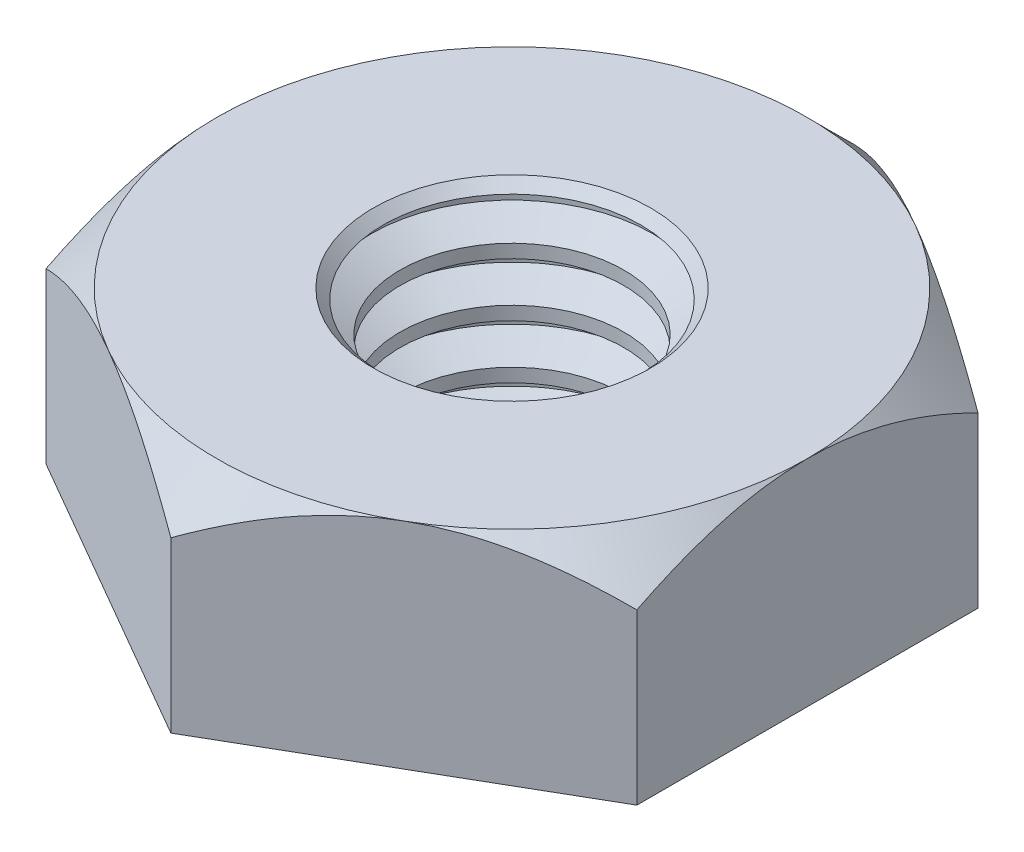
ISO-10303-21;
HEADER;
FILE_DESCRIPTION(('STEP AP214'),'2;1');
FILE_NAME('part.step','',(''),(''),'','','');
FILE_SCHEMA(('AUTOMOTIVE_DESIGN { 1 0 10303 214 1 1 1 1 }'));
ENDSEC;
DATA;
#1=APPLICATION_CONTEXT('core data for automotive mechanical design processes');
#2=APPLICATION_PROTOCOL_DEFINITION('international standard','automotive_design',2000,#1);
#3=PRODUCT_CONTEXT('',#1,'mechanical');
#4=PRODUCT('Part','Part','',(#3));
#5=PRODUCT_RELATED_PRODUCT_CATEGORY('part','',(#4));
#6=PRODUCT_DEFINITION_FORMATION('','',#4);
#7=PRODUCT_DEFINITION_CONTEXT('part definition',#1,'design');
#8=PRODUCT_DEFINITION('design','',#6,#7);
#9=PRODUCT_DEFINITION_SHAPE('','',#8);
#10=(LENGTH_UNIT() NAMED_UNIT(*) SI_UNIT(.MILLI.,.METRE.));
#11=(NAMED_UNIT(*) PLANE_ANGLE_UNIT() SI_UNIT($,.RADIAN.));
#12=(NAMED_UNIT(*) SI_UNIT($,.STERADIAN.) SOLID_ANGLE_UNIT());
#13=UNCERTAINTY_MEASURE_WITH_UNIT(LENGTH_MEASURE(1.E-05),#10,'distance_accuracy_value','');
#14=(GEOMETRIC_REPRESENTATION_CONTEXT(3) GLOBAL_UNCERTAINTY_ASSIGNED_CONTEXT((#13)) GLOBAL_UNIT_ASSIGNED_CONTEXT((#10,
#11,#12)) REPRESENTATION_CONTEXT('',''));
#15=CARTESIAN_POINT('',(0.,0.,0.));
#16=DIRECTION('',(0.,0.,1.));
#17=DIRECTION('',(1.,0.,0.));
#18=AXIS2_PLACEMENT_3D('',#15,#16,#17);
#19=CARTESIAN_POINT('',(4.365625,0.,-2.52049476893096));
#20=DIRECTION('',(0.,-1.,0.));
#21=DIRECTION('',(0.,0.,-1.));
#22=AXIS2_PLACEMENT_3D('',#19,#20,#21);
#23=PLANE('',#22);
#24=DIRECTION('',(-0.866025403784439,0.,-0.5));
#25=VECTOR('',#24,1.);
#26=CARTESIAN_POINT('',(4.365625,0.,-2.52049476893096));
#27=LINE('',#26,#25);
#28=CARTESIAN_POINT('',(4.365625,0.,-2.52049476893096));
#29=VERTEX_POINT('',#28);
#30=CARTESIAN_POINT('',(0.,0.,-5.04098953786192));
#31=VERTEX_POINT('',#30);
#32=EDGE_CURVE('E235',#29,#31,#27,.T.);
#33=ORIENTED_EDGE('',*,*,#32,.F.);
#34=DIRECTION('',(0.,0.,-1.));
#35=VECTOR('',#34,1.);
#36=CARTESIAN_POINT('',(4.365625,0.,2.52049476893096));
#37=LINE('',#36,#35);
#38=CARTESIAN_POINT('',(4.365625,0.,2.52049476893096));
#39=VERTEX_POINT('',#38);
#40=EDGE_CURVE('E297',#39,#29,#37,.T.);
#41=ORIENTED_EDGE('',*,*,#40,.F.);
#42=DIRECTION('',(0.866025403784439,0.,-0.5));
#43=VECTOR('',#42,1.);
#44=CARTESIAN_POINT('',(0.,0.,5.04098953786192));
#45=LINE('',#44,#43);
#46=CARTESIAN_POINT('',(0.,0.,5.04098953786192));
#47=VERTEX_POINT('',#46);
#48=EDGE_CURVE('E296',#47,#39,#45,.T.);
#49=ORIENTED_EDGE('',*,*,#48,.F.);
#50=DIRECTION('',(0.866025403784439,0.,0.5));
#51=VECTOR('',#50,1.);
#52=CARTESIAN_POINT('',(-4.365625,0.,2.52049476893096));
#53=LINE('',#52,#51);
#54=CARTESIAN_POINT('',(-4.365625,0.,2.52049476893096));
#55=VERTEX_POINT('',#54);
#56=EDGE_CURVE('E119',#55,#47,#53,.T.);
#57=ORIENTED_EDGE('',*,*,#56,.F.);
#58=DIRECTION('',(0.,0.,1.));
#59=VECTOR('',#58,1.);
#60=CARTESIAN_POINT('',(-4.365625,0.,-2.52049476893096));
#61=LINE('',#60,#59);
#62=CARTESIAN_POINT('',(-4.365625,0.,-2.52049476893096));
#63=VERTEX_POINT('',#62);
#64=EDGE_CURVE('E302',#63,#55,#61,.T.);
#65=ORIENTED_EDGE('',*,*,#64,.F.);
#66=DIRECTION('',(-0.866025403784439,0.,0.5));
#67=VECTOR('',#66,1.);
#68=CARTESIAN_POINT('',(0.,0.,-5.04098953786192));
#69=LINE('',#68,#67);
#70=EDGE_CURVE('E305',#31,#63,#69,.T.);
#71=ORIENTED_EDGE('',*,*,#70,.F.);
#72=EDGE_LOOP('',(#33,#41,#49,#57,#65,#71));
#73=FACE_BOUND('',#72,.T.);
#74=CARTESIAN_POINT('',(0.,0.,0.));
#75=DIRECTION('',(0.,1.,0.));
#76=DIRECTION('',(0.,0.,1.));
#77=AXIS2_PLACEMENT_3D('',#74,#75,#76);
#78=CIRCLE('',#77,1.65317020984131);
#79=CARTESIAN_POINT('',(0.,0.,1.65317020984131));
#80=VERTEX_POINT('',#79);
#81=EDGE_CURVE('E238',#80,#80,#78,.T.);
#82=ORIENTED_EDGE('',*,*,#81,.T.);
#83=EDGE_LOOP('',(#82));
#84=FACE_BOUND('',#83,.T.);
#85=ADVANCED_FACE('F29',(#73,#84),#23,.T.);
#86=CARTESIAN_POINT('',(4.365625,3.175,-2.52049476893096));
#87=DIRECTION('',(0.,-1.,0.));
#88=DIRECTION('',(0.,0.,-1.));
#89=AXIS2_PLACEMENT_3D('',#86,#87,#88);
#90=PLANE('',#89);
#91=CARTESIAN_POINT('',(0.,3.175,0.));
#92=DIRECTION('',(0.,-1.,0.));
#93=DIRECTION('',(0.,0.,-1.));
#94=AXIS2_PLACEMENT_3D('',#91,#92,#93);
#95=CIRCLE('',#94,2.05004520984131);
#96=CARTESIAN_POINT('',(0.,3.175,-2.05004520984131));
#97=VERTEX_POINT('',#96);
#98=EDGE_CURVE('E11',#97,#97,#95,.T.);
#99=ORIENTED_EDGE('',*,*,#98,.T.);
#100=EDGE_LOOP('',(#99));
#101=FACE_BOUND('',#100,.T.);
#102=CARTESIAN_POINT('',(0.,3.175,0.));
#103=DIRECTION('',(0.,-1.,0.));
#104=DIRECTION('',(0.,0.,-1.));
#105=AXIS2_PLACEMENT_3D('',#102,#103,#104);
#106=CIRCLE('',#105,4.365625);
#107=CARTESIAN_POINT('',(2.1828125,3.175,-3.78074215339644));
#108=VERTEX_POINT('',#107);
#109=CARTESIAN_POINT('',(4.365625,3.175,0.));
#110=VERTEX_POINT('',#109);
#111=EDGE_CURVE('E136',#108,#110,#106,.T.);
#112=ORIENTED_EDGE('',*,*,#111,.F.);
#113=CARTESIAN_POINT('',(-2.1828125,3.175,-3.78074215339644));
#114=VERTEX_POINT('',#113);
#115=EDGE_CURVE('E133',#114,#108,#106,.T.);
#116=ORIENTED_EDGE('',*,*,#115,.F.);
#117=CARTESIAN_POINT('',(-4.365625,3.175,0.));
#118=VERTEX_POINT('',#117);
#119=EDGE_CURVE('E135',#118,#114,#106,.T.);
#120=ORIENTED_EDGE('',*,*,#119,.F.);
#121=CARTESIAN_POINT('',(-2.1828125,3.175,3.78074215339644));
#122=VERTEX_POINT('',#121);
#123=EDGE_CURVE('E144',#122,#118,#106,.T.);
#124=ORIENTED_EDGE('',*,*,#123,.F.);
#125=CARTESIAN_POINT('',(2.1828125,3.175,3.78074215339644));
#126=VERTEX_POINT('',#125);
#127=EDGE_CURVE('E103',#126,#122,#106,.T.);
#128=ORIENTED_EDGE('',*,*,#127,.F.);
#129=CARTESIAN_POINT('',(0.,3.175,0.));
#130=DIRECTION('',(0.,1.,0.));
#131=DIRECTION('',(0.,0.,1.));
#132=AXIS2_PLACEMENT_3D('',#129,#130,#131);
#133=CIRCLE('',#132,4.365625);
#134=EDGE_CURVE('E286',#126,#110,#133,.T.);
#135=ORIENTED_EDGE('',*,*,#134,.T.);
#136=EDGE_LOOP('',(#112,#116,#120,#124,#128,#135));
#137=FACE_BOUND('',#136,.T.);
#138=ADVANCED_FACE('F165',(#101,#137),#90,.F.);
#139=CARTESIAN_POINT('',(4.365625,3.175,-2.52049476893096));
#140=DIRECTION('',(-0.5,0.,0.866025403784439));
#141=DIRECTION('',(0.866025403784439,0.,0.5));
#142=AXIS2_PLACEMENT_3D('',#139,#140,#141);
#143=PLANE('',#142);
#144=CARTESIAN_POINT('',(4.365825,2.49951998811686,-2.52037929887712));
#145=CARTESIAN_POINT('',(4.29075926179721,2.5428556843937,-2.56371852303542));
#146=CARTESIAN_POINT('',(4.21511652405692,2.58486150694082,-2.60739087803202));
#147=CARTESIAN_POINT('',(4.06256384257887,2.66580884918542,-2.69546720974897));
#148=CARTESIAN_POINT('',(3.98565323405556,2.70474869521597,-2.73987157028344));
#149=CARTESIAN_POINT('',(3.75213521872552,2.81669452590529,-2.87469325929487));
#150=CARTESIAN_POINT('',(3.59355091897805,2.88434920314825,-2.96625194744332));
#151=CARTESIAN_POINT('',(3.27375295789606,3.00020333018922,-3.1508873863603));
#152=CARTESIAN_POINT('',(3.11262104210946,3.0486946690912,-3.24391694131473));
#153=CARTESIAN_POINT('',(2.86827398509099,3.1047873481826,-3.38499078046004));
#154=CARTESIAN_POINT('',(2.78646520845364,3.12070335091413,-3.43222309967369));
#155=CARTESIAN_POINT('',(2.62215493673047,3.14662706744581,-3.52708767928368));
#156=CARTESIAN_POINT('',(2.53965354705096,3.15663566431487,-3.57471987882366));
#157=CARTESIAN_POINT('',(2.33861197089847,3.17341632845891,-3.69079128693361));
#158=CARTESIAN_POINT('',(2.21985517581475,3.17693743451114,-3.75935555454329));
#159=CARTESIAN_POINT('',(1.98255559506511,3.17102881515629,-3.89636053136768));
#160=CARTESIAN_POINT('',(1.8640128990038,3.16159454983167,-3.96480118884914));
#161=CARTESIAN_POINT('',(1.62804507322986,3.13033130179081,-4.10103727657982));
#162=CARTESIAN_POINT('',(1.51062134300582,3.10848845674929,-4.16883189883392));
#163=CARTESIAN_POINT('',(1.27779209770266,3.05359557133502,-4.30325592628491));
#164=CARTESIAN_POINT('',(1.16238642859219,3.02054639026254,-4.36988542041185));
#165=CARTESIAN_POINT('',(0.957514998599651,2.9525520763163,-4.48816799566731));
#166=CARTESIAN_POINT('',(0.867595701157642,2.91939475932441,-4.5400829262508));
#167=CARTESIAN_POINT('',(0.689371364291641,2.84773661607479,-4.64298079511652));
#168=CARTESIAN_POINT('',(0.601066374030608,2.80923562738386,-4.69396370501452));
#169=CARTESIAN_POINT('',(0.426348771558843,2.72775327359755,-4.79483695983376));
#170=CARTESIAN_POINT('',(0.339931190163338,2.68478599766643,-4.84473017371517));
#171=CARTESIAN_POINT('',(0.168696346553446,2.5949352561683,-4.94359265676798));
#172=CARTESIAN_POINT('',(0.0838781412149943,2.54805419303698,-4.99256247045232));
#173=CARTESIAN_POINT('',(-0.000199999999998944,2.49951998811687,-5.04110500791576));
#174=B_SPLINE_CURVE_WITH_KNOTS('',3,(#144,#145,#146,#147,#148,#149,#150,#151,#152,#153,#154,
#155,#156,#157,#158,#159,#160,#161,#162,#163,#164,#165,#166,#167,#168,#169,#170,#171,#172,#173),
.UNSPECIFIED.,.F.,.F.,(4,2,2,2,2,2,2,2,2,2,2,2,2,2,4),(0.,0.290706610356816,0.581570828097978,
1.16643976138302,1.74202094661304,2.02924700568145,2.31643011786515,2.72731191561999,
3.13833773437735,3.54982363883689,3.96127799774813,4.28811145534738,4.61495484997813,
4.94079680753749,5.26644020086356),.UNSPECIFIED.);
#175=CARTESIAN_POINT('',(4.365625,2.49963546213809,-2.52049476893096));
#176=VERTEX_POINT('',#175);
#177=EDGE_CURVE('E306',#176,#108,#174,.T.);
#178=ORIENTED_EDGE('',*,*,#177,.F.);
#179=DIRECTION('',(0.,-1.,0.));
#180=VECTOR('',#179,1.);
#181=CARTESIAN_POINT('',(4.365625,3.175,-2.52049476893096));
#182=LINE('',#181,#180);
#183=EDGE_CURVE('E126',#176,#29,#182,.T.);
#184=ORIENTED_EDGE('',*,*,#183,.T.);
#185=ORIENTED_EDGE('',*,*,#32,.T.);
#186=DIRECTION('',(0.,-1.,0.));
#187=VECTOR('',#186,1.);
#188=CARTESIAN_POINT('',(0.,3.175,-5.04098953786192));
#189=LINE('',#188,#187);
#190=CARTESIAN_POINT('',(0.,2.49963546213809,-5.04098953786192));
#191=VERTEX_POINT('',#190);
#192=EDGE_CURVE('E131',#191,#31,#189,.T.);
#193=ORIENTED_EDGE('',*,*,#192,.F.);
#194=EDGE_CURVE('E161',#108,#191,#174,.T.);
#195=ORIENTED_EDGE('',*,*,#194,.F.);
#196=EDGE_LOOP('',(#178,#184,#185,#193,#195));
#197=FACE_BOUND('',#196,.T.);
#198=ADVANCED_FACE('F31',(#197),#143,.F.);
#199=CARTESIAN_POINT('',(0.,3.175,-5.04098953786192));
#200=DIRECTION('',(0.5,0.,0.866025403784439));
#201=DIRECTION('',(0.866025403784439,0.,-0.5));
#202=AXIS2_PLACEMENT_3D('',#199,#200,#201);
#203=PLANE('',#202);
#204=CARTESIAN_POINT('',(0.000200000000000553,2.49951998811686,-5.04110500791576));
#205=CARTESIAN_POINT('',(-0.0748657382027878,2.5428556843937,-4.99776578375746));
#206=CARTESIAN_POINT('',(-0.150508475943082,2.58486150694082,-4.95409342876086));
#207=CARTESIAN_POINT('',(-0.303061157421127,2.66580884918542,-4.86601709704391));
#208=CARTESIAN_POINT('',(-0.379971765944438,2.70474869521597,-4.82161273650944));
#209=CARTESIAN_POINT('',(-0.613489781274476,2.81669452590529,-4.68679104749802));
#210=CARTESIAN_POINT('',(-0.772074081021945,2.88434920314825,-4.59523235934957));
#211=CARTESIAN_POINT('',(-1.09187204210394,3.00020333018922,-4.41059692043259));
#212=CARTESIAN_POINT('',(-1.25300395789054,3.04869466909121,-4.31756736547815));
#213=CARTESIAN_POINT('',(-1.49735101490901,3.1047873481826,-4.17649352633284));
#214=CARTESIAN_POINT('',(-1.57915979154636,3.12070335091413,-4.12926120711919));
#215=CARTESIAN_POINT('',(-1.74347006326953,3.14662706744581,-4.0343966275092));
#216=CARTESIAN_POINT('',(-1.82597145294904,3.15663566431487,-3.98676442796922));
#217=CARTESIAN_POINT('',(-2.02701302910153,3.17341632845891,-3.87069301985927));
#218=CARTESIAN_POINT('',(-2.14576982418525,3.17693743451114,-3.80212875224959));
#219=CARTESIAN_POINT('',(-2.38306940493489,3.17102881515629,-3.6651237754252));
#220=CARTESIAN_POINT('',(-2.5016121009962,3.16159454983167,-3.59668311794374));
#221=CARTESIAN_POINT('',(-2.73757992677014,3.13033130179081,-3.46044703021306));
#222=CARTESIAN_POINT('',(-2.85500365699418,3.10848845674929,-3.39265240795897));
#223=CARTESIAN_POINT('',(-3.08783290229734,3.05359557133502,-3.25822838050797));
#224=CARTESIAN_POINT('',(-3.20323857140781,3.02054639026254,-3.19159888638103));
#225=CARTESIAN_POINT('',(-3.40811000140035,2.9525520763163,-3.07331631112557));
#226=CARTESIAN_POINT('',(-3.49802929884236,2.91939475932441,-3.02140138054209));
#227=CARTESIAN_POINT('',(-3.67625363570836,2.84773661607479,-2.91850351167636));
#228=CARTESIAN_POINT('',(-3.76455862596939,2.80923562738387,-2.86752060177837));
#229=CARTESIAN_POINT('',(-3.93927622844116,2.72775327359755,-2.76664734695913));
#230=CARTESIAN_POINT('',(-4.02569380983666,2.68478599766643,-2.71675413307771));
#231=CARTESIAN_POINT('',(-4.19692865344655,2.5949352561683,-2.6178916500249));
#232=CARTESIAN_POINT('',(-4.28174685878501,2.54805419303699,-2.56892183634056));
#233=CARTESIAN_POINT('',(-4.365825,2.49951998811687,-2.52037929887712));
#234=B_SPLINE_CURVE_WITH_KNOTS('',3,(#204,#205,#206,#207,#208,#209,#210,#211,#212,#213,#214,
#215,#216,#217,#218,#219,#220,#221,#222,#223,#224,#225,#226,#227,#228,#229,#230,#231,#232,#233),
.UNSPECIFIED.,.F.,.F.,(4,2,2,2,2,2,2,2,2,2,2,2,2,2,4),(0.,0.290706610356815,0.581570828097978,
1.16643976138302,1.74202094661304,2.02924700568145,2.31643011786515,2.72731191561999,
3.13833773437735,3.54982363883689,3.96127799774813,4.28811145534738,4.61495484997813,
4.94079680753749,5.26644020086356),.UNSPECIFIED.);
#235=EDGE_CURVE('E158',#191,#114,#234,.T.);
#236=ORIENTED_EDGE('',*,*,#235,.F.);
#237=ORIENTED_EDGE('',*,*,#192,.T.);
#238=ORIENTED_EDGE('',*,*,#70,.T.);
#239=DIRECTION('',(0.,-1.,0.));
#240=VECTOR('',#239,1.);
#241=CARTESIAN_POINT('',(-4.365625,3.175,-2.52049476893096));
#242=LINE('',#241,#240);
#243=CARTESIAN_POINT('',(-4.365625,2.49963546213809,-2.52049476893096));
#244=VERTEX_POINT('',#243);
#245=EDGE_CURVE('E124',#244,#63,#242,.T.);
#246=ORIENTED_EDGE('',*,*,#245,.F.);
#247=EDGE_CURVE('E150',#114,#244,#234,.T.);
#248=ORIENTED_EDGE('',*,*,#247,.F.);
#249=EDGE_LOOP('',(#236,#237,#238,#246,#248));
#250=FACE_BOUND('',#249,.T.);
#251=ADVANCED_FACE('F167',(#250),#203,.F.);
#252=CARTESIAN_POINT('',(-4.365625,3.175,-2.52049476893096));
#253=DIRECTION('',(1.,0.,0.));
#254=DIRECTION('',(0.,0.,-1.));
#255=AXIS2_PLACEMENT_3D('',#252,#253,#254);
#256=PLANE('',#255);
#257=CARTESIAN_POINT('',(-4.365625,0.70491257966135,-5.26006489056432));
#258=CARTESIAN_POINT('',(-4.365625,0.802678929837933,-5.13298418598179));
#259=CARTESIAN_POINT('',(-4.365625,0.899569220714151,-5.00521874689069));
#260=CARTESIAN_POINT('',(-4.365625,1.09119744425269,-4.74803852621459));
#261=CARTESIAN_POINT('',(-4.365625,1.18593486227081,-4.6186233615674));
#262=CARTESIAN_POINT('',(-4.365625,1.3735312940587,-4.35691808766541));
#263=CARTESIAN_POINT('',(-4.365625,1.46637017769497,-4.22461350133101));
#264=CARTESIAN_POINT('',(-4.365625,1.64881712700764,-3.95780239294875));
#265=CARTESIAN_POINT('',(-4.365625,1.73842541514535,-3.82329602344842));
#266=CARTESIAN_POINT('',(-4.365625,1.91923152416555,-3.54310038592311));
#267=CARTESIAN_POINT('',(-4.365625,2.0101698538518,-3.39724282764264));
#268=CARTESIAN_POINT('',(-4.365625,2.18640211336186,-3.10210247150436));
#269=CARTESIAN_POINT('',(-4.365625,2.27169509328475,-2.95281910287324));
#270=CARTESIAN_POINT('',(-4.365625,2.43482022055583,-2.65078628816501));
#271=CARTESIAN_POINT('',(-4.365625,2.51267426921964,-2.49804876401671));
#272=CARTESIAN_POINT('',(-4.365625,2.65917723070185,-2.18825597231203));
#273=CARTESIAN_POINT('',(-4.365625,2.72783048599296,-2.03120278408456));
#274=CARTESIAN_POINT('',(-4.365625,2.84724495878238,-1.72816423864563));
#275=CARTESIAN_POINT('',(-4.365625,2.89910313311001,-1.5826155847136));
#276=CARTESIAN_POINT('',(-4.365625,2.99116920619303,-1.2878101350948));
#277=CARTESIAN_POINT('',(-4.365625,3.03137636289259,-1.1385531038777));
#278=CARTESIAN_POINT('',(-4.365625,3.09729383406965,-0.839821854367569));
#279=CARTESIAN_POINT('',(-4.365625,3.12326744800821,-0.690406728134635));
#280=CARTESIAN_POINT('',(-4.365625,3.16017597579481,-0.389720117691567));
#281=CARTESIAN_POINT('',(-4.365625,3.17111400974627,-0.238449025197238));
#282=CARTESIAN_POINT('',(-4.365625,3.1770196548063,0.0577907271338072));
#283=CARTESIAN_POINT('',(-4.365625,3.17266407223423,0.202746020460245));
#284=CARTESIAN_POINT('',(-4.365625,3.14977668074263,0.491525443469046));
#285=CARTESIAN_POINT('',(-4.365625,3.13124358417652,0.63534946920736));
#286=CARTESIAN_POINT('',(-4.365625,3.08073406930189,0.923262931460914));
#287=CARTESIAN_POINT('',(-4.365625,3.04852030695866,1.0673100183025));
#288=CARTESIAN_POINT('',(-4.365625,2.97243663849279,1.35223202145247));
#289=CARTESIAN_POINT('',(-4.365625,2.92856739438755,1.49310711743332));
#290=CARTESIAN_POINT('',(-4.365625,2.82829132796462,1.77944606428932));
#291=CARTESIAN_POINT('',(-4.365625,2.77130692063028,1.92470532838635));
#292=CARTESIAN_POINT('',(-4.365625,2.64853439221219,2.21148751875443));
#293=CARTESIAN_POINT('',(-4.365625,2.58274230151922,2.35300872565198));
#294=CARTESIAN_POINT('',(-4.365625,2.44391465170222,2.63298314411336));
#295=CARTESIAN_POINT('',(-4.365625,2.37085678258172,2.77142520257403));
#296=CARTESIAN_POINT('',(-4.365625,2.219105296034,3.04513698555421));
#297=CARTESIAN_POINT('',(-4.365625,2.14041254634271,3.18040719427782));
#298=CARTESIAN_POINT('',(-4.365625,1.98248926861825,3.44157865405833));
#299=CARTESIAN_POINT('',(-4.365625,1.90347719104141,3.56761269781683));
#300=CARTESIAN_POINT('',(-4.365625,1.74208988391647,3.81751542571875));
#301=CARTESIAN_POINT('',(-4.365625,1.6597144022184,3.9413839465179));
#302=CARTESIAN_POINT('',(-4.365625,1.4928706732036,4.18624305036429));
#303=CARTESIAN_POINT('',(-4.365625,1.4084245386336,4.30724875510755));
#304=CARTESIAN_POINT('',(-4.365625,1.23726856590243,4.54760013073487));
#305=CARTESIAN_POINT('',(-4.365625,1.1505593581824,4.66694625003688));
#306=CARTESIAN_POINT('',(-4.365625,1.06292381609542,4.78559619977847));
#307=B_SPLINE_CURVE_WITH_KNOTS('',3,(#257,#258,#259,#260,#261,#262,#263,#264,#265,#266,#267,
#268,#269,#270,#271,#272,#273,#274,#275,#276,#277,#278,#279,#280,#281,#282,#283,#284,#285,#286,
#287,#288,#289,#290,#291,#292,#293,#294,#295,#296,#297,#298,#299,#300,#301,#302,#303,#304,#305,
#306),.UNSPECIFIED.,.F.,.F.,(4,2,2,2,2,2,2,2,2,2,2,2,2,2,2,2,2,2,2,2,2,2,2,2,4),(0.,
0.481018057807077,0.962149918440635,1.44699361883673,1.93180386850032,2.44735513975326,
2.96299293959461,3.47706255965263,3.99088869478828,4.4540225010778,4.9171857979802,
5.37146415229228,5.82564822294317,6.25999088997208,6.69437301005721,7.13662055973024,
7.57884299564044,8.0465946946902,8.51455792293896,8.984005234889,9.45338040975316,
9.8995771725938,10.3458074478608,10.7884549913015,11.2309805122862),.UNSPECIFIED.);
#308=EDGE_CURVE('E152',#244,#118,#307,.T.);
#309=ORIENTED_EDGE('',*,*,#308,.F.);
#310=ORIENTED_EDGE('',*,*,#245,.T.);
#311=ORIENTED_EDGE('',*,*,#64,.T.);
#312=DIRECTION('',(0.,-1.,0.));
#313=VECTOR('',#312,1.);
#314=CARTESIAN_POINT('',(-4.365625,3.175,2.52049476893096));
#315=LINE('',#314,#313);
#316=CARTESIAN_POINT('',(-4.365625,2.49963546213809,2.52049476893096));
#317=VERTEX_POINT('',#316);
#318=EDGE_CURVE('E121',#317,#55,#315,.T.);
#319=ORIENTED_EDGE('',*,*,#318,.F.);
#320=EDGE_CURVE('E169',#118,#317,#307,.T.);
#321=ORIENTED_EDGE('',*,*,#320,.F.);
#322=EDGE_LOOP('',(#309,#310,#311,#319,#321));
#323=FACE_BOUND('',#322,.T.);
#324=ADVANCED_FACE('F216',(#323),#256,.F.);
#325=CARTESIAN_POINT('',(-4.365625,3.175,2.52049476893096));
#326=DIRECTION('',(0.5,0.,-0.866025403784438));
#327=DIRECTION('',(-0.866025403784439,0.,-0.5));
#328=AXIS2_PLACEMENT_3D('',#325,#326,#327);
#329=PLANE('',#328);
#330=CARTESIAN_POINT('',(-4.365825,2.49951998811687,2.52037929887712));
#331=CARTESIAN_POINT('',(-4.29075926179721,2.5428556843937,2.56371852303542));
#332=CARTESIAN_POINT('',(-4.21511652405692,2.58486150694082,2.60739087803202));
#333=CARTESIAN_POINT('',(-4.06256384257887,2.66580884918542,2.69546720974897));
#334=CARTESIAN_POINT('',(-3.98565323405556,2.70474869521597,2.73987157028344));
#335=CARTESIAN_POINT('',(-3.75213521872552,2.81669452590529,2.87469325929486));
#336=CARTESIAN_POINT('',(-3.59355091897806,2.88434920314825,2.96625194744331));
#337=CARTESIAN_POINT('',(-3.27375295789606,3.00020333018922,3.15088738636029));
#338=CARTESIAN_POINT('',(-3.11262104210946,3.04869466909121,3.24391694131473));
#339=CARTESIAN_POINT('',(-2.86827398509099,3.1047873481826,3.38499078046004));
#340=CARTESIAN_POINT('',(-2.78646520845364,3.12070335091413,3.43222309967369));
#341=CARTESIAN_POINT('',(-2.62215493673047,3.14662706744581,3.52708767928368));
#342=CARTESIAN_POINT('',(-2.53965354705097,3.15663566431487,3.57471987882366));
#343=CARTESIAN_POINT('',(-2.33861197089847,3.17341632845891,3.69079128693361));
#344=CARTESIAN_POINT('',(-2.21985517581475,3.17693743451114,3.75935555454329));
#345=CARTESIAN_POINT('',(-1.98255559506511,3.17102881515629,3.89636053136768));
#346=CARTESIAN_POINT('',(-1.8640128990038,3.16159454983167,3.96480118884914));
#347=CARTESIAN_POINT('',(-1.62804507322986,3.13033130179081,4.10103727657982));
#348=CARTESIAN_POINT('',(-1.51062134300582,3.10848845674929,4.16883189883391));
#349=CARTESIAN_POINT('',(-1.27779209770267,3.05359557133503,4.30325592628491));
#350=CARTESIAN_POINT('',(-1.16238642859219,3.02054639026254,4.36988542041185));
#351=CARTESIAN_POINT('',(-0.957514998599654,2.9525520763163,4.48816799566731));
#352=CARTESIAN_POINT('',(-0.867595701157644,2.91939475932441,4.54008292625079));
#353=CARTESIAN_POINT('',(-0.689371364291643,2.84773661607479,4.64298079511652));
#354=CARTESIAN_POINT('',(-0.601066374030609,2.80923562738387,4.69396370501452));
#355=CARTESIAN_POINT('',(-0.426348771558844,2.72775327359755,4.79483695983376));
#356=CARTESIAN_POINT('',(-0.339931190163339,2.68478599766643,4.84473017371517));
#357=CARTESIAN_POINT('',(-0.168696346553446,2.5949352561683,4.94359265676798));
#358=CARTESIAN_POINT('',(-0.0838781412149944,2.54805419303699,4.99256247045232));
#359=CARTESIAN_POINT('',(0.000199999999999471,2.49951998811687,5.04110500791576));
#360=B_SPLINE_CURVE_WITH_KNOTS('',3,(#330,#331,#332,#333,#334,#335,#336,#337,#338,#339,#340,
#341,#342,#343,#344,#345,#346,#347,#348,#349,#350,#351,#352,#353,#354,#355,#356,#357,#358,#359),
.UNSPECIFIED.,.F.,.F.,(4,2,2,2,2,2,2,2,2,2,2,2,2,2,4),(0.,0.290706610356814,0.581570828097976,
1.16643976138302,1.74202094661304,2.02924700568145,2.31643011786515,2.72731191561999,
3.13833773437735,3.54982363883689,3.96127799774813,4.28811145534737,4.61495484997813,
4.94079680753749,5.26644020086356),.UNSPECIFIED.);
#361=EDGE_CURVE('E53',#317,#122,#360,.T.);
#362=ORIENTED_EDGE('',*,*,#361,.F.);
#363=ORIENTED_EDGE('',*,*,#318,.T.);
#364=ORIENTED_EDGE('',*,*,#56,.T.);
#365=DIRECTION('',(0.,-1.,0.));
#366=VECTOR('',#365,1.);
#367=CARTESIAN_POINT('',(0.,3.175,5.04098953786192));
#368=LINE('',#367,#366);
#369=CARTESIAN_POINT('',(0.,2.49963546213809,5.04098953786192));
#370=VERTEX_POINT('',#369);
#371=EDGE_CURVE('E112',#370,#47,#368,.T.);
#372=ORIENTED_EDGE('',*,*,#371,.F.);
#373=EDGE_CURVE('E100',#122,#370,#360,.T.);
#374=ORIENTED_EDGE('',*,*,#373,.F.);
#375=EDGE_LOOP('',(#362,#363,#364,#372,#374));
#376=FACE_BOUND('',#375,.T.);
#377=ADVANCED_FACE('F117',(#376),#329,.F.);
#378=CARTESIAN_POINT('',(0.,3.175,5.04098953786192));
#379=DIRECTION('',(-0.5,0.,-0.866025403784439));
#380=DIRECTION('',(-0.866025403784439,0.,0.5));
#381=AXIS2_PLACEMENT_3D('',#378,#379,#380);
#382=PLANE('',#381);
#383=CARTESIAN_POINT('',(-0.000200000000000518,2.49951998811687,5.04110500791576));
#384=CARTESIAN_POINT('',(0.0748657382027877,2.5428556843937,4.99776578375746));
#385=CARTESIAN_POINT('',(0.150508475943082,2.58486150694082,4.95409342876086));
#386=CARTESIAN_POINT('',(0.303061157421127,2.66580884918542,4.86601709704391));
#387=CARTESIAN_POINT('',(0.379971765944438,2.70474869521597,4.82161273650944));
#388=CARTESIAN_POINT('',(0.613489781274476,2.81669452590529,4.68679104749802));
#389=CARTESIAN_POINT('',(0.772074081021945,2.88434920314825,4.59523235934957));
#390=CARTESIAN_POINT('',(1.09187204210394,3.00020333018922,4.41059692043258));
#391=CARTESIAN_POINT('',(1.25300395789054,3.04869466909121,4.31756736547815));
#392=CARTESIAN_POINT('',(1.49735101490901,3.1047873481826,4.17649352633284));
#393=CARTESIAN_POINT('',(1.57915979154636,3.12070335091413,4.12926120711919));
#394=CARTESIAN_POINT('',(1.74347006326953,3.14662706744581,4.0343966275092));
#395=CARTESIAN_POINT('',(1.82597145294904,3.15663566431487,3.98676442796922));
#396=CARTESIAN_POINT('',(2.02701302910153,3.17341632845891,3.87069301985927));
#397=CARTESIAN_POINT('',(2.14576982418525,3.17693743451114,3.80212875224959));
#398=CARTESIAN_POINT('',(2.38306940493489,3.17102881515629,3.6651237754252));
#399=CARTESIAN_POINT('',(2.5016121009962,3.16159454983167,3.59668311794374));
#400=CARTESIAN_POINT('',(2.73757992677014,3.13033130179081,3.46044703021306));
#401=CARTESIAN_POINT('',(2.85500365699418,3.10848845674929,3.39265240795896));
#402=CARTESIAN_POINT('',(3.08783290229734,3.05359557133502,3.25822838050797));
#403=CARTESIAN_POINT('',(3.20323857140781,3.02054639026254,3.19159888638103));
#404=CARTESIAN_POINT('',(3.40811000140035,2.9525520763163,3.07331631112557));
#405=CARTESIAN_POINT('',(3.49802929884236,2.91939475932441,3.02140138054209));
#406=CARTESIAN_POINT('',(3.67625363570836,2.84773661607479,2.91850351167636));
#407=CARTESIAN_POINT('',(3.76455862596939,2.80923562738386,2.86752060177836));
#408=CARTESIAN_POINT('',(3.93927622844116,2.72775327359755,2.76664734695912));
#409=CARTESIAN_POINT('',(4.02569380983666,2.68478599766643,2.71675413307771));
#410=CARTESIAN_POINT('',(4.19692865344655,2.5949352561683,2.6178916500249));
#411=CARTESIAN_POINT('',(4.281746858785,2.54805419303699,2.56892183634056));
#412=CARTESIAN_POINT('',(4.365825,2.49951998811687,2.52037929887712));
#413=B_SPLINE_CURVE_WITH_KNOTS('',3,(#383,#384,#385,#386,#387,#388,#389,#390,#391,#392,#393,
#394,#395,#396,#397,#398,#399,#400,#401,#402,#403,#404,#405,#406,#407,#408,#409,#410,#411,#412),
.UNSPECIFIED.,.F.,.F.,(4,2,2,2,2,2,2,2,2,2,2,2,2,2,4),(0.,0.290706610356815,0.581570828097978,
1.16643976138302,1.74202094661304,2.02924700568145,2.31643011786515,2.72731191561999,
3.13833773437735,3.54982363883689,3.96127799774813,4.28811145534738,4.61495484997813,
4.94079680753749,5.26644020086356),.UNSPECIFIED.);
#414=EDGE_CURVE('E45',#370,#126,#413,.T.);
#415=ORIENTED_EDGE('',*,*,#414,.F.);
#416=ORIENTED_EDGE('',*,*,#371,.T.);
#417=ORIENTED_EDGE('',*,*,#48,.T.);
#418=DIRECTION('',(0.,-1.,0.));
#419=VECTOR('',#418,1.);
#420=CARTESIAN_POINT('',(4.365625,3.175,2.52049476893096));
#421=LINE('',#420,#419);
#422=CARTESIAN_POINT('',(4.365625,2.49963546213809,2.52049476893096));
#423=VERTEX_POINT('',#422);
#424=EDGE_CURVE('E122',#423,#39,#421,.T.);
#425=ORIENTED_EDGE('',*,*,#424,.F.);
#426=EDGE_CURVE('E115',#126,#423,#413,.T.);
#427=ORIENTED_EDGE('',*,*,#426,.F.);
#428=EDGE_LOOP('',(#415,#416,#417,#425,#427));
#429=FACE_BOUND('',#428,.T.);
#430=ADVANCED_FACE('F110',(#429),#382,.F.);
#431=CARTESIAN_POINT('',(4.365625,3.175,2.52049476893096));
#432=DIRECTION('',(-1.,0.,0.));
#433=DIRECTION('',(0.,0.,1.));
#434=AXIS2_PLACEMENT_3D('',#431,#432,#433);
#435=PLANE('',#434);
#436=CARTESIAN_POINT('',(4.365625,0.704912579661348,-5.26006489056433));
#437=CARTESIAN_POINT('',(4.365625,0.802678929837932,-5.1329841859818));
#438=CARTESIAN_POINT('',(4.365625,0.89956922071415,-5.00521874689069));
#439=CARTESIAN_POINT('',(4.365625,1.09119744425269,-4.7480385262146));
#440=CARTESIAN_POINT('',(4.365625,1.18593486227081,-4.6186233615674));
#441=CARTESIAN_POINT('',(4.365625,1.3735312940587,-4.35691808766542));
#442=CARTESIAN_POINT('',(4.365625,1.46637017769497,-4.22461350133101));
#443=CARTESIAN_POINT('',(4.365625,1.64881712700763,-3.95780239294876));
#444=CARTESIAN_POINT('',(4.365625,1.73842541514534,-3.82329602344843));
#445=CARTESIAN_POINT('',(4.365625,1.91923152416555,-3.54310038592311));
#446=CARTESIAN_POINT('',(4.365625,2.0101698538518,-3.39724282764264));
#447=CARTESIAN_POINT('',(4.365625,2.18640211336186,-3.10210247150436));
#448=CARTESIAN_POINT('',(4.365625,2.27169509328475,-2.95281910287325));
#449=CARTESIAN_POINT('',(4.365625,2.43482022055583,-2.65078628816501));
#450=CARTESIAN_POINT('',(4.365625,2.51267426921964,-2.49804876401671));
#451=CARTESIAN_POINT('',(4.365625,2.65917723070185,-2.18825597231203));
#452=CARTESIAN_POINT('',(4.365625,2.72783048599296,-2.03120278408456));
#453=CARTESIAN_POINT('',(4.365625,2.84724495878238,-1.72816423864564));
#454=CARTESIAN_POINT('',(4.365625,2.89910313311001,-1.58261558471361));
#455=CARTESIAN_POINT('',(4.365625,2.99116920619303,-1.2878101350948));
#456=CARTESIAN_POINT('',(4.365625,3.03137636289259,-1.1385531038777));
#457=CARTESIAN_POINT('',(4.365625,3.09729383406965,-0.839821854367569));
#458=CARTESIAN_POINT('',(4.365625,3.12326744800821,-0.690406728134635));
#459=CARTESIAN_POINT('',(4.365625,3.16017597579481,-0.389720117691567));
#460=CARTESIAN_POINT('',(4.365625,3.17111400974627,-0.238449025197238));
#461=CARTESIAN_POINT('',(4.365625,3.1770196548063,0.057790727133807));
#462=CARTESIAN_POINT('',(4.365625,3.17266407223424,0.202746020460245));
#463=CARTESIAN_POINT('',(4.365625,3.14977668074263,0.491525443469046));
#464=CARTESIAN_POINT('',(4.365625,3.13124358417652,0.63534946920736));
#465=CARTESIAN_POINT('',(4.365625,3.08073406930189,0.923262931460914));
#466=CARTESIAN_POINT('',(4.365625,3.04852030695866,1.0673100183025));
#467=CARTESIAN_POINT('',(4.365625,2.97243663849279,1.35223202145247));
#468=CARTESIAN_POINT('',(4.365625,2.92856739438755,1.49310711743332));
#469=CARTESIAN_POINT('',(4.365625,2.82829132796462,1.77944606428932));
#470=CARTESIAN_POINT('',(4.365625,2.77130692063028,1.92470532838635));
#471=CARTESIAN_POINT('',(4.365625,2.64853439221219,2.21148751875443));
#472=CARTESIAN_POINT('',(4.365625,2.58274230151922,2.35300872565198));
#473=CARTESIAN_POINT('',(4.365625,2.44391465170222,2.63298314411336));
#474=CARTESIAN_POINT('',(4.365625,2.37085678258172,2.77142520257403));
#475=CARTESIAN_POINT('',(4.365625,2.219105296034,3.04513698555421));
#476=CARTESIAN_POINT('',(4.365625,2.14041254634271,3.18040719427782));
#477=CARTESIAN_POINT('',(4.365625,1.98248926861825,3.44157865405832));
#478=CARTESIAN_POINT('',(4.365625,1.90347719104141,3.56761269781683));
#479=CARTESIAN_POINT('',(4.365625,1.74208988391648,3.81751542571875));
#480=CARTESIAN_POINT('',(4.365625,1.6597144022184,3.9413839465179));
#481=CARTESIAN_POINT('',(4.365625,1.49287067320361,4.18624305036429));
#482=CARTESIAN_POINT('',(4.365625,1.4084245386336,4.30724875510755));
#483=CARTESIAN_POINT('',(4.365625,1.23726856590244,4.54760013073487));
#484=CARTESIAN_POINT('',(4.365625,1.1505593581824,4.66694625003688));
#485=CARTESIAN_POINT('',(4.365625,1.06292381609542,4.78559619977847));
#486=B_SPLINE_CURVE_WITH_KNOTS('',3,(#436,#437,#438,#439,#440,#441,#442,#443,#444,#445,#446,
#447,#448,#449,#450,#451,#452,#453,#454,#455,#456,#457,#458,#459,#460,#461,#462,#463,#464,#465,
#466,#467,#468,#469,#470,#471,#472,#473,#474,#475,#476,#477,#478,#479,#480,#481,#482,#483,#484,
#485),.UNSPECIFIED.,.F.,.F.,(4,2,2,2,2,2,2,2,2,2,2,2,2,2,2,2,2,2,2,2,2,2,2,2,4),(0.,
0.481018057807077,0.962149918440635,1.44699361883673,1.93180386850032,2.44735513975326,
2.96299293959461,3.47706255965263,3.99088869478828,4.4540225010778,4.91718579798021,
5.37146415229228,5.82564822294318,6.25999088997209,6.69437301005721,7.13662055973024,
7.57884299564045,8.0465946946902,8.51455792293897,8.98400523488901,9.45338040975316,
9.8995771725938,10.3458074478608,10.7884549913015,11.2309805122862),.UNSPECIFIED.);
#487=EDGE_CURVE('E287',#423,#110,#486,.F.);
#488=ORIENTED_EDGE('',*,*,#487,.F.);
#489=ORIENTED_EDGE('',*,*,#424,.T.);
#490=ORIENTED_EDGE('',*,*,#40,.T.);
#491=ORIENTED_EDGE('',*,*,#183,.F.);
#492=EDGE_CURVE('E197',#110,#176,#486,.F.);
#493=ORIENTED_EDGE('',*,*,#492,.F.);
#494=EDGE_LOOP('',(#488,#489,#490,#491,#493));
#495=FACE_BOUND('',#494,.T.);
#496=ADVANCED_FACE('F293',(#495),#435,.F.);
#497=CARTESIAN_POINT('',(0.,3.175,0.));
#498=DIRECTION('',(0.,-1.,0.));
#499=DIRECTION('',(0.,0.,-1.));
#500=AXIS2_PLACEMENT_3D('',#497,#498,#499);
#501=CONICAL_SURFACE('',#500,4.365625,0.785398163397454);
#502=ORIENTED_EDGE('',*,*,#194,.T.);
#503=ORIENTED_EDGE('',*,*,#235,.T.);
#504=ORIENTED_EDGE('',*,*,#115,.T.);
#505=EDGE_LOOP('',(#502,#503,#504));
#506=FACE_BOUND('',#505,.T.);
#507=ADVANCED_FACE('F159',(#506),#501,.T.);
#508=ORIENTED_EDGE('',*,*,#247,.T.);
#509=ORIENTED_EDGE('',*,*,#308,.T.);
#510=ORIENTED_EDGE('',*,*,#119,.T.);
#511=EDGE_LOOP('',(#508,#509,#510));
#512=FACE_BOUND('',#511,.T.);
#513=ADVANCED_FACE('F148',(#512),#501,.T.);
#514=ORIENTED_EDGE('',*,*,#320,.T.);
#515=ORIENTED_EDGE('',*,*,#361,.T.);
#516=ORIENTED_EDGE('',*,*,#123,.T.);
#517=EDGE_LOOP('',(#514,#515,#516));
#518=FACE_BOUND('',#517,.T.);
#519=ADVANCED_FACE('F310',(#518),#501,.T.);
#520=ORIENTED_EDGE('',*,*,#373,.T.);
#521=ORIENTED_EDGE('',*,*,#414,.T.);
#522=ORIENTED_EDGE('',*,*,#127,.T.);
#523=EDGE_LOOP('',(#520,#521,#522));
#524=FACE_BOUND('',#523,.T.);
#525=ADVANCED_FACE('F101',(#524),#501,.T.);
#526=ORIENTED_EDGE('',*,*,#426,.T.);
#527=ORIENTED_EDGE('',*,*,#487,.T.);
#528=ORIENTED_EDGE('',*,*,#134,.F.);
#529=EDGE_LOOP('',(#526,#527,#528));
#530=FACE_BOUND('',#529,.T.);
#531=ADVANCED_FACE('F191',(#530),#501,.T.);
#532=ORIENTED_EDGE('',*,*,#177,.T.);
#533=ORIENTED_EDGE('',*,*,#111,.T.);
#534=ORIENTED_EDGE('',*,*,#492,.T.);
#535=EDGE_LOOP('',(#532,#533,#534));
#536=FACE_BOUND('',#535,.T.);
#537=ADVANCED_FACE('F185',(#536),#501,.T.);
#538=CARTESIAN_POINT('',(0.,2.926953125,0.));
#539=DIRECTION('',(0.,-1.,0.));
#540=DIRECTION('',(0.,0.,-1.));
#541=AXIS2_PLACEMENT_3D('',#538,#539,#540);
#542=CONICAL_SURFACE('',#541,2.0828,1.0471975511966);
#543=CARTESIAN_POINT('',(0.,3.02973366787305,0.));
#544=DIRECTION('',(0.,-1.,0.));
#545=DIRECTION('',(0.,0.,-1.));
#546=AXIS2_PLACEMENT_3D('',#543,#544,#545);
#547=CIRCLE('',#546,1.90477887771436);
#548=CARTESIAN_POINT('',(0.,3.02973366787305,-1.90477887771436));
#549=VERTEX_POINT('',#548);
#550=EDGE_CURVE('E38',#549,#549,#547,.F.);
#551=ORIENTED_EDGE('',*,*,#550,.T.);
#552=EDGE_LOOP('',(#551));
#553=FACE_BOUND('',#552,.T.);
#554=CARTESIAN_POINT('',(0.,2.926953125,0.));
#555=DIRECTION('',(0.,1.,0.));
#556=DIRECTION('',(0.,0.,1.));
#557=AXIS2_PLACEMENT_3D('',#554,#555,#556);
#558=CIRCLE('',#557,2.0828);
#559=CARTESIAN_POINT('',(0.,2.926953125,2.0828));
#560=VERTEX_POINT('',#559);
#561=EDGE_CURVE('E284',#560,#560,#558,.T.);
#562=ORIENTED_EDGE('',*,*,#561,.F.);
#563=EDGE_LOOP('',(#562));
#564=FACE_BOUND('',#563,.T.);
#565=ADVANCED_FACE('F190',(#553,#564),#542,.F.);
#566=CARTESIAN_POINT('',(0.,1.66357854098429,0.));
#567=DIRECTION('',(0.,1.,0.));
#568=DIRECTION('',(0.,0.,1.));
#569=AXIS2_PLACEMENT_3D('',#566,#567,#568);
#570=CYLINDRICAL_SURFACE('',#569,2.0828);
#571=ORIENTED_EDGE('',*,*,#561,.T.);
#572=EDGE_LOOP('',(#571));
#573=FACE_BOUND('',#572,.T.);
#574=CARTESIAN_POINT('',(0.,2.827734375,0.));
#575=DIRECTION('',(0.,1.,0.));
#576=DIRECTION('',(0.,0.,1.));
#577=AXIS2_PLACEMENT_3D('',#574,#575,#576);
#578=CIRCLE('',#577,2.0828);
#579=CARTESIAN_POINT('',(0.,2.827734375,2.0828));
#580=VERTEX_POINT('',#579);
#581=EDGE_CURVE('E281',#580,#580,#578,.T.);
#582=ORIENTED_EDGE('',*,*,#581,.F.);
#583=EDGE_LOOP('',(#582));
#584=FACE_BOUND('',#583,.T.);
#585=ADVANCED_FACE('F372',(#573,#584),#570,.F.);
#586=CARTESIAN_POINT('',(0.,2.5796875,0.));
#587=DIRECTION('',(0.,1.,0.));
#588=DIRECTION('',(0.,0.,1.));
#589=AXIS2_PLACEMENT_3D('',#586,#587,#588);
#590=CONICAL_SURFACE('',#589,1.65317020984131,1.0471975511966);
#591=ORIENTED_EDGE('',*,*,#581,.T.);
#592=EDGE_LOOP('',(#591));
#593=FACE_BOUND('',#592,.T.);
#594=CARTESIAN_POINT('',(0.,2.5796875,0.));
#595=DIRECTION('',(0.,1.,0.));
#596=DIRECTION('',(0.,0.,1.));
#597=AXIS2_PLACEMENT_3D('',#594,#595,#596);
#598=CIRCLE('',#597,1.65317020984131);
#599=CARTESIAN_POINT('',(0.,2.5796875,1.65317020984131));
#600=VERTEX_POINT('',#599);
#601=EDGE_CURVE('E278',#600,#600,#598,.T.);
#602=ORIENTED_EDGE('',*,*,#601,.F.);
#603=EDGE_LOOP('',(#602));
#604=FACE_BOUND('',#603,.T.);
#605=ADVANCED_FACE('F482',(#593,#604),#590,.F.);
#606=CARTESIAN_POINT('',(0.,1.66357854098429,0.));
#607=DIRECTION('',(0.,1.,0.));
#608=DIRECTION('',(0.,0.,1.));
#609=AXIS2_PLACEMENT_3D('',#606,#607,#608);
#610=CYLINDRICAL_SURFACE('',#609,1.65317020984131);
#611=ORIENTED_EDGE('',*,*,#601,.T.);
#612=EDGE_LOOP('',(#611));
#613=FACE_BOUND('',#612,.T.);
#614=CARTESIAN_POINT('',(0.,2.38125,0.));
#615=DIRECTION('',(0.,1.,0.));
#616=DIRECTION('',(0.,0.,1.));
#617=AXIS2_PLACEMENT_3D('',#614,#615,#616);
#618=CIRCLE('',#617,1.65317020984131);
#619=CARTESIAN_POINT('',(0.,2.38125,1.65317020984131));
#620=VERTEX_POINT('',#619);
#621=EDGE_CURVE('E275',#620,#620,#618,.T.);
#622=ORIENTED_EDGE('',*,*,#621,.F.);
#623=EDGE_LOOP('',(#622));
#624=FACE_BOUND('',#623,.T.);
#625=ADVANCED_FACE('F474',(#613,#624),#610,.F.);
#626=CARTESIAN_POINT('',(0.,2.133203125,0.));
#627=DIRECTION('',(0.,-1.,0.));
#628=DIRECTION('',(0.,0.,-1.));
#629=AXIS2_PLACEMENT_3D('',#626,#627,#628);
#630=CONICAL_SURFACE('',#629,2.0828,1.0471975511966);
#631=ORIENTED_EDGE('',*,*,#621,.T.);
#632=EDGE_LOOP('',(#631));
#633=FACE_BOUND('',#632,.T.);
#634=CARTESIAN_POINT('',(0.,2.133203125,0.));
#635=DIRECTION('',(0.,1.,0.));
#636=DIRECTION('',(0.,0.,1.));
#637=AXIS2_PLACEMENT_3D('',#634,#635,#636);
#638=CIRCLE('',#637,2.0828);
#639=CARTESIAN_POINT('',(0.,2.133203125,2.0828));
#640=VERTEX_POINT('',#639);
#641=EDGE_CURVE('E272',#640,#640,#638,.T.);
#642=ORIENTED_EDGE('',*,*,#641,.F.);
#643=EDGE_LOOP('',(#642));
#644=FACE_BOUND('',#643,.T.);
#645=ADVANCED_FACE('F466',(#633,#644),#630,.F.);
#646=CARTESIAN_POINT('',(0.,0.869828540984293,0.));
#647=DIRECTION('',(0.,1.,0.));
#648=DIRECTION('',(0.,0.,1.));
#649=AXIS2_PLACEMENT_3D('',#646,#647,#648);
#650=CYLINDRICAL_SURFACE('',#649,2.0828);
#651=ORIENTED_EDGE('',*,*,#641,.T.);
#652=EDGE_LOOP('',(#651));
#653=FACE_BOUND('',#652,.T.);
#654=CARTESIAN_POINT('',(0.,2.033984375,0.));
#655=DIRECTION('',(0.,1.,0.));
#656=DIRECTION('',(0.,0.,1.));
#657=AXIS2_PLACEMENT_3D('',#654,#655,#656);
#658=CIRCLE('',#657,2.0828);
#659=CARTESIAN_POINT('',(0.,2.033984375,2.0828));
#660=VERTEX_POINT('',#659);
#661=EDGE_CURVE('E269',#660,#660,#658,.T.);
#662=ORIENTED_EDGE('',*,*,#661,.F.);
#663=EDGE_LOOP('',(#662));
#664=FACE_BOUND('',#663,.T.);
#665=ADVANCED_FACE('F458',(#653,#664),#650,.F.);
#666=CARTESIAN_POINT('',(0.,1.7859375,0.));
#667=DIRECTION('',(0.,1.,0.));
#668=DIRECTION('',(0.,0.,1.));
#669=AXIS2_PLACEMENT_3D('',#666,#667,#668);
#670=CONICAL_SURFACE('',#669,1.65317020984131,1.0471975511966);
#671=ORIENTED_EDGE('',*,*,#661,.T.);
#672=EDGE_LOOP('',(#671));
#673=FACE_BOUND('',#672,.T.);
#674=CARTESIAN_POINT('',(0.,1.7859375,0.));
#675=DIRECTION('',(0.,1.,0.));
#676=DIRECTION('',(0.,0.,1.));
#677=AXIS2_PLACEMENT_3D('',#674,#675,#676);
#678=CIRCLE('',#677,1.65317020984131);
#679=CARTESIAN_POINT('',(0.,1.7859375,1.65317020984131));
#680=VERTEX_POINT('',#679);
#681=EDGE_CURVE('E266',#680,#680,#678,.T.);
#682=ORIENTED_EDGE('',*,*,#681,.F.);
#683=EDGE_LOOP('',(#682));
#684=FACE_BOUND('',#683,.T.);
#685=ADVANCED_FACE('F450',(#673,#684),#670,.F.);
#686=CARTESIAN_POINT('',(0.,0.869828540984293,0.));
#687=DIRECTION('',(0.,1.,0.));
#688=DIRECTION('',(0.,0.,1.));
#689=AXIS2_PLACEMENT_3D('',#686,#687,#688);
#690=CYLINDRICAL_SURFACE('',#689,1.65317020984131);
#691=ORIENTED_EDGE('',*,*,#681,.T.);
#692=EDGE_LOOP('',(#691));
#693=FACE_BOUND('',#692,.T.);
#694=CARTESIAN_POINT('',(0.,1.5875,0.));
#695=DIRECTION('',(0.,1.,0.));
#696=DIRECTION('',(0.,0.,1.));
#697=AXIS2_PLACEMENT_3D('',#694,#695,#696);
#698=CIRCLE('',#697,1.65317020984131);
#699=CARTESIAN_POINT('',(0.,1.5875,1.65317020984131));
#700=VERTEX_POINT('',#699);
#701=EDGE_CURVE('E263',#700,#700,#698,.T.);
#702=ORIENTED_EDGE('',*,*,#701,.F.);
#703=EDGE_LOOP('',(#702));
#704=FACE_BOUND('',#703,.T.);
#705=ADVANCED_FACE('F442',(#693,#704),#690,.F.);
#706=CARTESIAN_POINT('',(0.,1.339453125,0.));
#707=DIRECTION('',(0.,-1.,0.));
#708=DIRECTION('',(0.,0.,-1.));
#709=AXIS2_PLACEMENT_3D('',#706,#707,#708);
#710=CONICAL_SURFACE('',#709,2.0828,1.0471975511966);
#711=ORIENTED_EDGE('',*,*,#701,.T.);
#712=EDGE_LOOP('',(#711));
#713=FACE_BOUND('',#712,.T.);
#714=CARTESIAN_POINT('',(0.,1.339453125,0.));
#715=DIRECTION('',(0.,1.,0.));
#716=DIRECTION('',(0.,0.,1.));
#717=AXIS2_PLACEMENT_3D('',#714,#715,#716);
#718=CIRCLE('',#717,2.0828);
#719=CARTESIAN_POINT('',(0.,1.339453125,2.0828));
#720=VERTEX_POINT('',#719);
#721=EDGE_CURVE('E260',#720,#720,#718,.T.);
#722=ORIENTED_EDGE('',*,*,#721,.F.);
#723=EDGE_LOOP('',(#722));
#724=FACE_BOUND('',#723,.T.);
#725=ADVANCED_FACE('F434',(#713,#724),#710,.F.);
#726=CARTESIAN_POINT('',(0.,0.0760785409842932,0.));
#727=DIRECTION('',(0.,1.,0.));
#728=DIRECTION('',(0.,0.,1.));
#729=AXIS2_PLACEMENT_3D('',#726,#727,#728);
#730=CYLINDRICAL_SURFACE('',#729,2.0828);
#731=ORIENTED_EDGE('',*,*,#721,.T.);
#732=EDGE_LOOP('',(#731));
#733=FACE_BOUND('',#732,.T.);
#734=CARTESIAN_POINT('',(0.,1.240234375,0.));
#735=DIRECTION('',(0.,1.,0.));
#736=DIRECTION('',(0.,0.,1.));
#737=AXIS2_PLACEMENT_3D('',#734,#735,#736);
#738=CIRCLE('',#737,2.0828);
#739=CARTESIAN_POINT('',(0.,1.240234375,2.0828));
#740=VERTEX_POINT('',#739);
#741=EDGE_CURVE('E257',#740,#740,#738,.T.);
#742=ORIENTED_EDGE('',*,*,#741,.F.);
#743=EDGE_LOOP('',(#742));
#744=FACE_BOUND('',#743,.T.);
#745=ADVANCED_FACE('F426',(#733,#744),#730,.F.);
#746=CARTESIAN_POINT('',(0.,0.9921875,0.));
#747=DIRECTION('',(0.,1.,0.));
#748=DIRECTION('',(0.,0.,1.));
#749=AXIS2_PLACEMENT_3D('',#746,#747,#748);
#750=CONICAL_SURFACE('',#749,1.65317020984131,1.0471975511966);
#751=ORIENTED_EDGE('',*,*,#741,.T.);
#752=EDGE_LOOP('',(#751));
#753=FACE_BOUND('',#752,.T.);
#754=CARTESIAN_POINT('',(0.,0.9921875,0.));
#755=DIRECTION('',(0.,1.,0.));
#756=DIRECTION('',(0.,0.,1.));
#757=AXIS2_PLACEMENT_3D('',#754,#755,#756);
#758=CIRCLE('',#757,1.65317020984131);
#759=CARTESIAN_POINT('',(0.,0.9921875,1.65317020984131));
#760=VERTEX_POINT('',#759);
#761=EDGE_CURVE('E254',#760,#760,#758,.T.);
#762=ORIENTED_EDGE('',*,*,#761,.F.);
#763=EDGE_LOOP('',(#762));
#764=FACE_BOUND('',#763,.T.);
#765=ADVANCED_FACE('F418',(#753,#764),#750,.F.);
#766=CARTESIAN_POINT('',(0.,0.0760785409842932,0.));
#767=DIRECTION('',(0.,1.,0.));
#768=DIRECTION('',(0.,0.,1.));
#769=AXIS2_PLACEMENT_3D('',#766,#767,#768);
#770=CYLINDRICAL_SURFACE('',#769,1.65317020984131);
#771=ORIENTED_EDGE('',*,*,#761,.T.);
#772=EDGE_LOOP('',(#771));
#773=FACE_BOUND('',#772,.T.);
#774=CARTESIAN_POINT('',(0.,0.79375,0.));
#775=DIRECTION('',(0.,1.,0.));
#776=DIRECTION('',(0.,0.,1.));
#777=AXIS2_PLACEMENT_3D('',#774,#775,#776);
#778=CIRCLE('',#777,1.65317020984131);
#779=CARTESIAN_POINT('',(0.,0.79375,1.65317020984131));
#780=VERTEX_POINT('',#779);
#781=EDGE_CURVE('E251',#780,#780,#778,.T.);
#782=ORIENTED_EDGE('',*,*,#781,.F.);
#783=EDGE_LOOP('',(#782));
#784=FACE_BOUND('',#783,.T.);
#785=ADVANCED_FACE('F410',(#773,#784),#770,.F.);
#786=CARTESIAN_POINT('',(0.,0.545703125,0.));
#787=DIRECTION('',(0.,-1.,0.));
#788=DIRECTION('',(0.,0.,-1.));
#789=AXIS2_PLACEMENT_3D('',#786,#787,#788);
#790=CONICAL_SURFACE('',#789,2.0828,1.0471975511966);
#791=ORIENTED_EDGE('',*,*,#781,.T.);
#792=EDGE_LOOP('',(#791));
#793=FACE_BOUND('',#792,.T.);
#794=CARTESIAN_POINT('',(0.,0.545703125,0.));
#795=DIRECTION('',(0.,1.,0.));
#796=DIRECTION('',(0.,0.,1.));
#797=AXIS2_PLACEMENT_3D('',#794,#795,#796);
#798=CIRCLE('',#797,2.0828);
#799=CARTESIAN_POINT('',(0.,0.545703125,2.0828));
#800=VERTEX_POINT('',#799);
#801=EDGE_CURVE('E248',#800,#800,#798,.T.);
#802=ORIENTED_EDGE('',*,*,#801,.F.);
#803=EDGE_LOOP('',(#802));
#804=FACE_BOUND('',#803,.T.);
#805=ADVANCED_FACE('F402',(#793,#804),#790,.F.);
#806=CARTESIAN_POINT('',(0.,-0.717671459015707,0.));
#807=DIRECTION('',(0.,1.,0.));
#808=DIRECTION('',(0.,0.,1.));
#809=AXIS2_PLACEMENT_3D('',#806,#807,#808);
#810=CYLINDRICAL_SURFACE('',#809,2.0828);
#811=ORIENTED_EDGE('',*,*,#801,.T.);
#812=EDGE_LOOP('',(#811));
#813=FACE_BOUND('',#812,.T.);
#814=CARTESIAN_POINT('',(0.,0.446484375,0.));
#815=DIRECTION('',(0.,1.,0.));
#816=DIRECTION('',(0.,0.,1.));
#817=AXIS2_PLACEMENT_3D('',#814,#815,#816);
#818=CIRCLE('',#817,2.0828);
#819=CARTESIAN_POINT('',(0.,0.446484375,2.0828));
#820=VERTEX_POINT('',#819);
#821=EDGE_CURVE('E243',#820,#820,#818,.T.);
#822=ORIENTED_EDGE('',*,*,#821,.F.);
#823=EDGE_LOOP('',(#822));
#824=FACE_BOUND('',#823,.T.);
#825=ADVANCED_FACE('F394',(#813,#824),#810,.F.);
#826=CARTESIAN_POINT('',(0.,0.1984375,0.));
#827=DIRECTION('',(0.,1.,0.));
#828=DIRECTION('',(0.,0.,1.));
#829=AXIS2_PLACEMENT_3D('',#826,#827,#828);
#830=CONICAL_SURFACE('',#829,1.65317020984131,1.0471975511966);
#831=ORIENTED_EDGE('',*,*,#821,.T.);
#832=EDGE_LOOP('',(#831));
#833=FACE_BOUND('',#832,.T.);
#834=CARTESIAN_POINT('',(0.,0.1984375,0.));
#835=DIRECTION('',(0.,1.,0.));
#836=DIRECTION('',(0.,0.,1.));
#837=AXIS2_PLACEMENT_3D('',#834,#835,#836);
#838=CIRCLE('',#837,1.65317020984131);
#839=CARTESIAN_POINT('',(0.,0.1984375,1.65317020984131));
#840=VERTEX_POINT('',#839);
#841=EDGE_CURVE('E240',#840,#840,#838,.T.);
#842=ORIENTED_EDGE('',*,*,#841,.F.);
#843=EDGE_LOOP('',(#842));
#844=FACE_BOUND('',#843,.T.);
#845=ADVANCED_FACE('F389',(#833,#844),#830,.F.);
#846=CARTESIAN_POINT('',(0.,-0.717671459015707,0.));
#847=DIRECTION('',(0.,1.,0.));
#848=DIRECTION('',(0.,0.,1.));
#849=AXIS2_PLACEMENT_3D('',#846,#847,#848);
#850=CYLINDRICAL_SURFACE('',#849,1.65317020984131);
#851=ORIENTED_EDGE('',*,*,#841,.T.);
#852=EDGE_LOOP('',(#851));
#853=FACE_BOUND('',#852,.T.);
#854=ORIENTED_EDGE('',*,*,#81,.F.);
#855=EDGE_LOOP('',(#854));
#856=FACE_BOUND('',#855,.T.);
#857=ADVANCED_FACE('F364',(#853,#856),#850,.F.);
#858=CARTESIAN_POINT('',(0.,3.02973366787305,0.));
#859=DIRECTION('',(0.,1.,0.));
#860=DIRECTION('',(0.,0.,1.));
#861=AXIS2_PLACEMENT_3D('',#858,#859,#860);
#862=CONICAL_SURFACE('',#861,1.90477887771436,0.785398163397448);
#863=ORIENTED_EDGE('',*,*,#98,.F.);
#864=EDGE_LOOP('',(#863));
#865=FACE_BOUND('',#864,.T.);
#866=ORIENTED_EDGE('',*,*,#550,.F.);
#867=EDGE_LOOP('',(#866));
#868=FACE_BOUND('',#867,.T.);
#869=ADVANCED_FACE('F378',(#865,#868),#862,.F.);
#870=CLOSED_SHELL('',(#85,#138,#198,#251,#324,#377,#430,#496,#507,#513,#519,#525,#531,#537,#565,
#585,#605,#625,#645,#665,#685,#705,#725,#745,#765,#785,#805,#825,#845,#857,#869));
#871=MANIFOLD_SOLID_BREP('B2',#870);
#872=ADVANCED_BREP_SHAPE_REPRESENTATION('',(#18,#871),#14);
#873=SHAPE_DEFINITION_REPRESENTATION(#9,#872);
ENDSEC;
END-ISO-10303-21;
